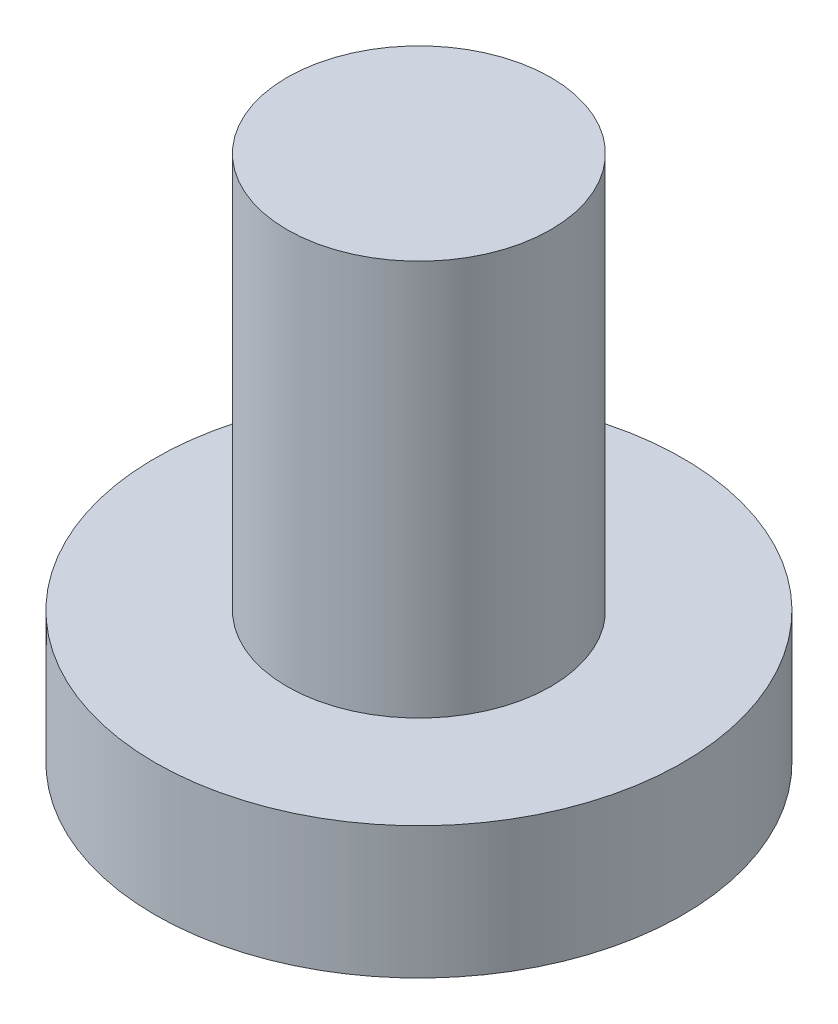
ISO-10303-21;
HEADER;
FILE_DESCRIPTION(('STEP AP214'),'2;1');
FILE_NAME('part.step','',(''),(''),'','','');
FILE_SCHEMA(('AUTOMOTIVE_DESIGN { 1 0 10303 214 1 1 1 1 }'));
ENDSEC;
DATA;
#1=APPLICATION_CONTEXT('core data for automotive mechanical design processes');
#2=APPLICATION_PROTOCOL_DEFINITION('international standard','automotive_design',2000,#1);
#3=PRODUCT_CONTEXT('',#1,'mechanical');
#4=PRODUCT('Part','Part','',(#3));
#5=PRODUCT_RELATED_PRODUCT_CATEGORY('part','',(#4));
#6=PRODUCT_DEFINITION_FORMATION('','',#4);
#7=PRODUCT_DEFINITION_CONTEXT('part definition',#1,'design');
#8=PRODUCT_DEFINITION('design','',#6,#7);
#9=PRODUCT_DEFINITION_SHAPE('','',#8);
#10=(LENGTH_UNIT() NAMED_UNIT(*) SI_UNIT(.MILLI.,.METRE.));
#11=(NAMED_UNIT(*) PLANE_ANGLE_UNIT() SI_UNIT($,.RADIAN.));
#12=(NAMED_UNIT(*) SI_UNIT($,.STERADIAN.) SOLID_ANGLE_UNIT());
#13=UNCERTAINTY_MEASURE_WITH_UNIT(LENGTH_MEASURE(1.E-05),#10,'distance_accuracy_value','');
#14=(GEOMETRIC_REPRESENTATION_CONTEXT(3) GLOBAL_UNCERTAINTY_ASSIGNED_CONTEXT((#13)) GLOBAL_UNIT_ASSIGNED_CONTEXT((#10,
#11,#12)) REPRESENTATION_CONTEXT('',''));
#15=CARTESIAN_POINT('',(0.,0.,0.));
#16=DIRECTION('',(0.,0.,1.));
#17=DIRECTION('',(1.,0.,0.));
#18=AXIS2_PLACEMENT_3D('',#15,#16,#17);
#19=CARTESIAN_POINT('',(0.,1.,0.));
#20=DIRECTION('',(0.,-1.,0.));
#21=DIRECTION('',(0.,0.,-1.));
#22=AXIS2_PLACEMENT_3D('',#19,#20,#21);
#23=CYLINDRICAL_SURFACE('',#22,2.);
#24=CARTESIAN_POINT('',(0.,1.,0.));
#25=DIRECTION('',(0.,1.,0.));
#26=DIRECTION('',(0.,0.,1.));
#27=AXIS2_PLACEMENT_3D('',#24,#25,#26);
#28=CIRCLE('',#27,2.);
#29=CARTESIAN_POINT('',(0.,1.,2.));
#30=VERTEX_POINT('',#29);
#31=EDGE_CURVE('E45',#30,#30,#28,.T.);
#32=ORIENTED_EDGE('',*,*,#31,.F.);
#33=EDGE_LOOP('',(#32));
#34=FACE_BOUND('',#33,.T.);
#35=CARTESIAN_POINT('',(0.,0.,0.));
#36=DIRECTION('',(0.,1.,0.));
#37=DIRECTION('',(0.,0.,1.));
#38=AXIS2_PLACEMENT_3D('',#35,#36,#37);
#39=CIRCLE('',#38,2.);
#40=CARTESIAN_POINT('',(0.,0.,2.));
#41=VERTEX_POINT('',#40);
#42=EDGE_CURVE('E40',#41,#41,#39,.T.);
#43=ORIENTED_EDGE('',*,*,#42,.T.);
#44=EDGE_LOOP('',(#43));
#45=FACE_BOUND('',#44,.T.);
#46=ADVANCED_FACE('F37',(#34,#45),#23,.T.);
#47=CARTESIAN_POINT('',(0.,1.,0.));
#48=DIRECTION('',(0.,1.,0.));
#49=DIRECTION('',(0.,0.,1.));
#50=AXIS2_PLACEMENT_3D('',#47,#48,#49);
#51=PLANE('',#50);
#52=CARTESIAN_POINT('',(0.,1.,0.));
#53=DIRECTION('',(0.,1.,0.));
#54=DIRECTION('',(0.,0.,1.));
#55=AXIS2_PLACEMENT_3D('',#52,#53,#54);
#56=CIRCLE('',#55,1.);
#57=CARTESIAN_POINT('',(0.,1.,1.));
#58=VERTEX_POINT('',#57);
#59=EDGE_CURVE('E10',#58,#58,#56,.T.);
#60=ORIENTED_EDGE('',*,*,#59,.F.);
#61=EDGE_LOOP('',(#60));
#62=FACE_BOUND('',#61,.T.);
#63=ORIENTED_EDGE('',*,*,#31,.T.);
#64=EDGE_LOOP('',(#63));
#65=FACE_BOUND('',#64,.T.);
#66=ADVANCED_FACE('F65',(#62,#65),#51,.T.);
#67=CARTESIAN_POINT('',(0.,0.,0.));
#68=DIRECTION('',(0.,1.,0.));
#69=DIRECTION('',(0.,0.,1.));
#70=AXIS2_PLACEMENT_3D('',#67,#68,#69);
#71=PLANE('',#70);
#72=ORIENTED_EDGE('',*,*,#42,.F.);
#73=EDGE_LOOP('',(#72));
#74=FACE_BOUND('',#73,.T.);
#75=ADVANCED_FACE('F62',(#74),#71,.F.);
#76=CARTESIAN_POINT('',(0.,4.,0.));
#77=DIRECTION('',(0.,-1.,0.));
#78=DIRECTION('',(0.,0.,-1.));
#79=AXIS2_PLACEMENT_3D('',#76,#77,#78);
#80=CYLINDRICAL_SURFACE('',#79,1.);
#81=CARTESIAN_POINT('',(0.,4.,0.));
#82=DIRECTION('',(0.,1.,0.));
#83=DIRECTION('',(0.,0.,1.));
#84=AXIS2_PLACEMENT_3D('',#81,#82,#83);
#85=CIRCLE('',#84,1.);
#86=CARTESIAN_POINT('',(0.,4.,1.));
#87=VERTEX_POINT('',#86);
#88=EDGE_CURVE('E52',#87,#87,#85,.T.);
#89=ORIENTED_EDGE('',*,*,#88,.F.);
#90=EDGE_LOOP('',(#89));
#91=FACE_BOUND('',#90,.T.);
#92=ORIENTED_EDGE('',*,*,#59,.T.);
#93=EDGE_LOOP('',(#92));
#94=FACE_BOUND('',#93,.T.);
#95=ADVANCED_FACE('F64',(#91,#94),#80,.T.);
#96=CARTESIAN_POINT('',(0.,4.,0.));
#97=DIRECTION('',(0.,1.,0.));
#98=DIRECTION('',(0.,0.,1.));
#99=AXIS2_PLACEMENT_3D('',#96,#97,#98);
#100=PLANE('',#99);
#101=ORIENTED_EDGE('',*,*,#88,.T.);
#102=EDGE_LOOP('',(#101));
#103=FACE_BOUND('',#102,.T.);
#104=ADVANCED_FACE('F70',(#103),#100,.T.);
#105=CLOSED_SHELL('',(#46,#66,#75,#95,#104));
#106=MANIFOLD_SOLID_BREP('B2',#105);
#107=ADVANCED_BREP_SHAPE_REPRESENTATION('',(#18,#106),#14);
#108=SHAPE_DEFINITION_REPRESENTATION(#9,#107);
ENDSEC;
END-ISO-10303-21;
